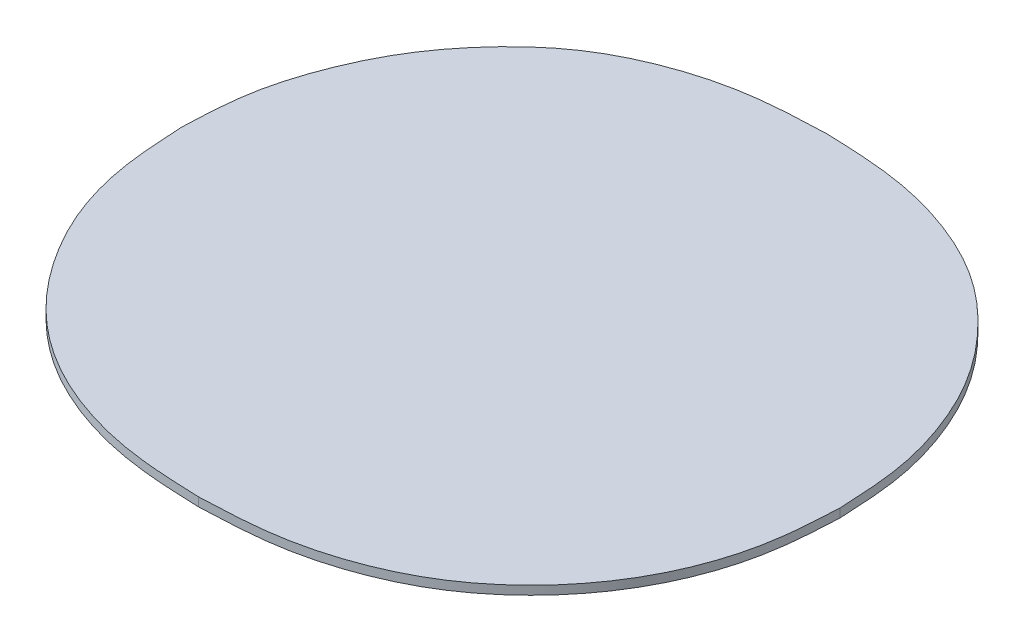
ISO-10303-21;
HEADER;
FILE_DESCRIPTION(('STEP AP214'),'2;1');
FILE_NAME('part.step','',(''),(''),'','','');
FILE_SCHEMA(('AUTOMOTIVE_DESIGN { 1 0 10303 214 1 1 1 1 }'));
ENDSEC;
DATA;
#1=APPLICATION_CONTEXT('core data for automotive mechanical design processes');
#2=APPLICATION_PROTOCOL_DEFINITION('international standard','automotive_design',2000,#1);
#3=PRODUCT_CONTEXT('',#1,'mechanical');
#4=PRODUCT('Part','Part','',(#3));
#5=PRODUCT_RELATED_PRODUCT_CATEGORY('part','',(#4));
#6=PRODUCT_DEFINITION_FORMATION('','',#4);
#7=PRODUCT_DEFINITION_CONTEXT('part definition',#1,'design');
#8=PRODUCT_DEFINITION('design','',#6,#7);
#9=PRODUCT_DEFINITION_SHAPE('','',#8);
#10=(LENGTH_UNIT() NAMED_UNIT(*) SI_UNIT(.MILLI.,.METRE.));
#11=(NAMED_UNIT(*) PLANE_ANGLE_UNIT() SI_UNIT($,.RADIAN.));
#12=(NAMED_UNIT(*) SI_UNIT($,.STERADIAN.) SOLID_ANGLE_UNIT());
#13=UNCERTAINTY_MEASURE_WITH_UNIT(LENGTH_MEASURE(1.E-05),#10,'distance_accuracy_value','');
#14=(GEOMETRIC_REPRESENTATION_CONTEXT(3) GLOBAL_UNCERTAINTY_ASSIGNED_CONTEXT((#13)) GLOBAL_UNIT_ASSIGNED_CONTEXT((#10,
#11,#12)) REPRESENTATION_CONTEXT('',''));
#15=CARTESIAN_POINT('',(0.,0.,0.));
#16=DIRECTION('',(0.,0.,1.));
#17=DIRECTION('',(1.,0.,0.));
#18=AXIS2_PLACEMENT_3D('',#15,#16,#17);
#19=CARTESIAN_POINT('',(0.007745843497059,6.,3.45268147772));
#20=DIRECTION('',(0.,-1.,3.619292183782E-13));
#21=DIRECTION('',(-1.,0.,0.));
#22=AXIS2_PLACEMENT_3D('',#19,#20,#21);
#23=PLANE('',#22);
#24=CARTESIAN_POINT('',(0.278414164254,6.,3.35562330677));
#25=CARTESIAN_POINT('',(0.249406832938,6.,3.356618688139));
#26=CARTESIAN_POINT('',(0.194479534186,6.,3.358503508541));
#27=CARTESIAN_POINT('',(0.117325820873,6.,3.379252633205));
#28=CARTESIAN_POINT('',(0.05028233269895,6.,3.412585695103));
#29=CARTESIAN_POINT('',(-0.003394474065828,6.,3.461246247859));
#30=CARTESIAN_POINT('',(-0.04635484666059,6.,3.517139603769));
#31=CARTESIAN_POINT('',(-0.07622178940424,6.,3.580280938425));
#32=CARTESIAN_POINT('',(-0.09617269501434,6.,3.648178507315));
#33=CARTESIAN_POINT('',(-0.0979894315795,6.,3.695763959134));
#34=CARTESIAN_POINT('',(-0.09891591307607,6.,3.720031121177));
#35=B_SPLINE_CURVE_WITH_KNOTS('',3,(#24,#25,#26,#27,#28,#29,#30,#31,#32,#33,#34),.UNSPECIFIED.,
.F.,.F.,(4,1,1,1,1,1,1,1,4),(0.,0.147070722438,0.278488131886,0.402823434919,0.523803973376,
0.643325091294,0.758850506969,0.877020946523,1.),.UNSPECIFIED.);
#36=CARTESIAN_POINT('',(0.278414164254,6.,3.35562330677));
#37=VERTEX_POINT('',#36);
#38=CARTESIAN_POINT('',(-0.09891591307607,6.,3.720031121177));
#39=VERTEX_POINT('',#38);
#40=EDGE_CURVE('E21',#37,#39,#35,.T.);
#41=ORIENTED_EDGE('',*,*,#40,.F.);
#42=CARTESIAN_POINT('',(0.657682581022,6.,3.720031121177));
#43=CARTESIAN_POINT('',(0.656501751618,6.,3.695340229959));
#44=CARTESIAN_POINT('',(0.654206855434,6.,3.647354439777));
#45=CARTESIAN_POINT('',(0.634460594808,6.,3.578539306237));
#46=CARTESIAN_POINT('',(0.603369311714,6.,3.515359088914));
#47=CARTESIAN_POINT('',(0.558844850105,6.,3.459826685172));
#48=CARTESIAN_POINT('',(0.504162955929,6.,3.41241901655));
#49=CARTESIAN_POINT('',(0.437309563432,6.,3.379166704267));
#50=CARTESIAN_POINT('',(0.361031610267,6.,3.358673341463));
#51=CARTESIAN_POINT('',(0.306766921803,6.,3.356670021457));
#52=CARTESIAN_POINT('',(0.278414164254,6.,3.35562330677));
#53=B_SPLINE_CURVE_WITH_KNOTS('',3,(#42,#43,#44,#45,#46,#47,#48,#49,#50,#51,#52),.UNSPECIFIED.,
.F.,.F.,(4,1,1,1,1,1,1,1,4),(0.,0.125140501017,0.243205713875,0.360575089902,0.480464490815,
0.602278419052,0.725031121478,0.85633150826,1.),.UNSPECIFIED.);
#54=CARTESIAN_POINT('',(0.657682581022,6.,3.720031121177));
#55=VERTEX_POINT('',#54);
#56=EDGE_CURVE('E30',#55,#37,#53,.T.);
#57=ORIENTED_EDGE('',*,*,#56,.F.);
#58=CARTESIAN_POINT('',(0.278414164254,6.,4.077331690978));
#59=CARTESIAN_POINT('',(0.306327278281,6.,4.076225642079));
#60=CARTESIAN_POINT('',(0.359880026209,6.,4.074103630261));
#61=CARTESIAN_POINT('',(0.435373317215,6.,4.054271015846));
#62=CARTESIAN_POINT('',(0.501969156188,6.,4.022337892375));
#63=CARTESIAN_POINT('',(0.557682396666,6.,3.977146928348));
#64=CARTESIAN_POINT('',(0.602533452824,6.,3.922804432609));
#65=CARTESIAN_POINT('',(0.63486365485,6.,3.860751853558));
#66=CARTESIAN_POINT('',(0.654059455164,6.,3.792229577449));
#67=CARTESIAN_POINT('',(0.656455129193,6.,3.744490698532));
#68=CARTESIAN_POINT('',(0.657682581022,6.,3.720031121177));
#69=B_SPLINE_CURVE_WITH_KNOTS('',3,(#58,#59,#60,#61,#62,#63,#64,#65,#66,#67,#68),.UNSPECIFIED.,
.F.,.F.,(4,1,1,1,1,1,1,1,4),(0.,0.142815348214,0.273998606379,0.396915772417,0.518617682172,
0.638605678926,0.755612013719,0.874784934405,1.),.UNSPECIFIED.);
#70=CARTESIAN_POINT('',(0.278414164254,6.,4.077331690978));
#71=VERTEX_POINT('',#70);
#72=EDGE_CURVE('E104',#71,#55,#69,.T.);
#73=ORIENTED_EDGE('',*,*,#72,.F.);
#74=CARTESIAN_POINT('',(-0.09891591307607,6.,3.720031121177));
#75=CARTESIAN_POINT('',(-0.09762280702379,6.,3.74425710157));
#76=CARTESIAN_POINT('',(-0.09510223079358,6.,3.791479392597));
#77=CARTESIAN_POINT('',(-0.07688443142966,6.,3.859490943886));
#78=CARTESIAN_POINT('',(-0.04464820256883,6.,3.920789872695));
#79=CARTESIAN_POINT('',(-0.001659156104891,6.,3.97601655347));
#80=CARTESIAN_POINT('',(0.05366003167216,6.,4.021750590806));
#81=CARTESIAN_POINT('',(0.120002053384,6.,4.054392398375));
#82=CARTESIAN_POINT('',(0.196095209431,6.,4.074171872897));
#83=CARTESIAN_POINT('',(0.250073367164,6.,4.07624382776));
#84=CARTESIAN_POINT('',(0.278414164254,6.,4.077331690978));
#85=B_SPLINE_CURVE_WITH_KNOTS('',3,(#74,#75,#76,#77,#78,#79,#80,#81,#82,#83,#84),.UNSPECIFIED.,
.F.,.F.,(4,1,1,1,1,1,1,1,4),(0.,0.124356659586,0.242401185633,0.358143816009,0.477839754427,
0.59961742931,0.7232639245,0.854701951811,1.),.UNSPECIFIED.);
#86=EDGE_CURVE('E66',#39,#71,#85,.T.);
#87=ORIENTED_EDGE('',*,*,#86,.F.);
#88=EDGE_LOOP('',(#41,#57,#73,#87));
#89=FACE_BOUND('',#88,.T.);
#90=ADVANCED_FACE('F16',(#89),#23,.T.);
#91=CARTESIAN_POINT('',(0.007745843497059,6.01,3.45268147772));
#92=DIRECTION('',(0.,-1.,3.619292183782E-13));
#93=DIRECTION('',(-1.,0.,0.));
#94=AXIS2_PLACEMENT_3D('',#91,#92,#93);
#95=PLANE('',#94);
#96=CARTESIAN_POINT('',(0.278414164254,6.01,3.35562330677));
#97=CARTESIAN_POINT('',(0.249406832938,6.01,3.356618688139));
#98=CARTESIAN_POINT('',(0.194479534186,6.01,3.358503508541));
#99=CARTESIAN_POINT('',(0.117325820873,6.01,3.379252633205));
#100=CARTESIAN_POINT('',(0.05028233269895,6.01,3.412585695103));
#101=CARTESIAN_POINT('',(-0.003394474065828,6.01,3.461246247859));
#102=CARTESIAN_POINT('',(-0.04635484666059,6.01,3.517139603769));
#103=CARTESIAN_POINT('',(-0.07622178940424,6.01,3.580280938425));
#104=CARTESIAN_POINT('',(-0.09617269501434,6.01,3.648178507315));
#105=CARTESIAN_POINT('',(-0.0979894315795,6.01,3.695763959134));
#106=CARTESIAN_POINT('',(-0.09891591307607,6.01,3.720031121177));
#107=B_SPLINE_CURVE_WITH_KNOTS('',3,(#96,#97,#98,#99,#100,#101,#102,#103,#104,#105,#106),
.UNSPECIFIED.,.F.,.F.,(4,1,1,1,1,1,1,1,4),(0.,0.147070722438,0.278488131886,0.402823434919,
0.523803973376,0.643325091294,0.758850506969,0.877020946523,1.),.UNSPECIFIED.);
#108=CARTESIAN_POINT('',(0.278414164254,6.01,3.35562330677));
#109=VERTEX_POINT('',#108);
#110=CARTESIAN_POINT('',(-0.09891591307607,6.01,3.720031121177));
#111=VERTEX_POINT('',#110);
#112=EDGE_CURVE('E86',#109,#111,#107,.T.);
#113=ORIENTED_EDGE('',*,*,#112,.T.);
#114=CARTESIAN_POINT('',(-0.09891591307607,6.01,3.720031121177));
#115=CARTESIAN_POINT('',(-0.09762280702379,6.01,3.74425710157));
#116=CARTESIAN_POINT('',(-0.09510223079358,6.01,3.791479392597));
#117=CARTESIAN_POINT('',(-0.07688443142966,6.01,3.859490943886));
#118=CARTESIAN_POINT('',(-0.04464820256883,6.01,3.920789872695));
#119=CARTESIAN_POINT('',(-0.001659156104891,6.01,3.97601655347));
#120=CARTESIAN_POINT('',(0.05366003167216,6.01,4.021750590806));
#121=CARTESIAN_POINT('',(0.120002053384,6.01,4.054392398375));
#122=CARTESIAN_POINT('',(0.196095209431,6.01,4.074171872897));
#123=CARTESIAN_POINT('',(0.250073367164,6.01,4.07624382776));
#124=CARTESIAN_POINT('',(0.278414164254,6.01,4.077331690978));
#125=B_SPLINE_CURVE_WITH_KNOTS('',3,(#114,#115,#116,#117,#118,#119,#120,#121,#122,#123,#124),
.UNSPECIFIED.,.F.,.F.,(4,1,1,1,1,1,1,1,4),(0.,0.124356659586,0.242401185633,0.358143816009,
0.477839754427,0.59961742931,0.7232639245,0.854701951811,1.),.UNSPECIFIED.);
#126=CARTESIAN_POINT('',(0.278414164254,6.01,4.077331690978));
#127=VERTEX_POINT('',#126);
#128=EDGE_CURVE('E109',#111,#127,#125,.T.);
#129=ORIENTED_EDGE('',*,*,#128,.T.);
#130=CARTESIAN_POINT('',(0.278414164254,6.01,4.077331690978));
#131=CARTESIAN_POINT('',(0.306327278281,6.01,4.076225642079));
#132=CARTESIAN_POINT('',(0.359880026209,6.01,4.074103630261));
#133=CARTESIAN_POINT('',(0.435373317215,6.01,4.054271015846));
#134=CARTESIAN_POINT('',(0.501969156188,6.01,4.022337892375));
#135=CARTESIAN_POINT('',(0.557682396666,6.01,3.977146928348));
#136=CARTESIAN_POINT('',(0.602533452824,6.01,3.922804432609));
#137=CARTESIAN_POINT('',(0.63486365485,6.01,3.860751853558));
#138=CARTESIAN_POINT('',(0.654059455164,6.01,3.792229577449));
#139=CARTESIAN_POINT('',(0.656455129193,6.01,3.744490698532));
#140=CARTESIAN_POINT('',(0.657682581022,6.01,3.720031121177));
#141=B_SPLINE_CURVE_WITH_KNOTS('',3,(#130,#131,#132,#133,#134,#135,#136,#137,#138,#139,#140),
.UNSPECIFIED.,.F.,.F.,(4,1,1,1,1,1,1,1,4),(0.,0.142815348214,0.273998606379,0.396915772417,
0.518617682172,0.638605678926,0.755612013719,0.874784934405,1.),.UNSPECIFIED.);
#142=CARTESIAN_POINT('',(0.657682581022,6.01,3.720031121177));
#143=VERTEX_POINT('',#142);
#144=EDGE_CURVE('E80',#127,#143,#141,.T.);
#145=ORIENTED_EDGE('',*,*,#144,.T.);
#146=CARTESIAN_POINT('',(0.657682581022,6.01,3.720031121177));
#147=CARTESIAN_POINT('',(0.656501751618,6.01,3.695340229959));
#148=CARTESIAN_POINT('',(0.654206855434,6.01,3.647354439777));
#149=CARTESIAN_POINT('',(0.634460594808,6.01,3.578539306237));
#150=CARTESIAN_POINT('',(0.603369311714,6.01,3.515359088914));
#151=CARTESIAN_POINT('',(0.558844850105,6.01,3.459826685172));
#152=CARTESIAN_POINT('',(0.504162955929,6.01,3.41241901655));
#153=CARTESIAN_POINT('',(0.437309563432,6.01,3.379166704267));
#154=CARTESIAN_POINT('',(0.361031610267,6.01,3.358673341463));
#155=CARTESIAN_POINT('',(0.306766921803,6.01,3.356670021457));
#156=CARTESIAN_POINT('',(0.278414164254,6.01,3.35562330677));
#157=B_SPLINE_CURVE_WITH_KNOTS('',3,(#146,#147,#148,#149,#150,#151,#152,#153,#154,#155,#156),
.UNSPECIFIED.,.F.,.F.,(4,1,1,1,1,1,1,1,4),(0.,0.125140501017,0.243205713875,0.360575089902,
0.480464490815,0.602278419052,0.725031121478,0.85633150826,1.),.UNSPECIFIED.);
#158=EDGE_CURVE('E11',#143,#109,#157,.T.);
#159=ORIENTED_EDGE('',*,*,#158,.T.);
#160=EDGE_LOOP('',(#113,#129,#145,#159));
#161=FACE_BOUND('',#160,.T.);
#162=ADVANCED_FACE('F160',(#161),#95,.F.);
#163=CARTESIAN_POINT('',(0.657682581022,6.01,3.720031121177));
#164=CARTESIAN_POINT('',(0.656501751618,6.01,3.695340229959));
#165=CARTESIAN_POINT('',(0.654206855434,6.01,3.647354439777));
#166=CARTESIAN_POINT('',(0.634460594808,6.01,3.578539306237));
#167=CARTESIAN_POINT('',(0.603369311714,6.01,3.515359088914));
#168=CARTESIAN_POINT('',(0.558844850105,6.01,3.459826685172));
#169=CARTESIAN_POINT('',(0.504162955929,6.01,3.41241901655));
#170=CARTESIAN_POINT('',(0.437309563432,6.01,3.379166704267));
#171=CARTESIAN_POINT('',(0.361031610267,6.01,3.358673341463));
#172=CARTESIAN_POINT('',(0.306766921803,6.01,3.356670021457));
#173=CARTESIAN_POINT('',(0.278414164254,6.01,3.35562330677));
#174=(BOUNDED_CURVE() B_SPLINE_CURVE(3,(#163,#164,#165,#166,#167,#168,#169,#170,#171,#172,#173),
.UNSPECIFIED.,.F.,.F.) B_SPLINE_CURVE_WITH_KNOTS((4,1,1,1,1,1,1,1,4),(0.,0.125140501017,
0.243205713875,0.360575089902,0.480464490815,0.602278419052,0.725031121478,0.85633150826,1.),
.UNSPECIFIED.) CURVE() GEOMETRIC_REPRESENTATION_ITEM() RATIONAL_B_SPLINE_CURVE((1.,1.,1.,1.,1.,
1.,1.,1.,1.,1.,1.)) REPRESENTATION_ITEM(''));
#175=DIRECTION('',(0.,-1.,0.));
#176=VECTOR('',#175,1.);
#177=SURFACE_OF_LINEAR_EXTRUSION('',#174,#176);
#178=ORIENTED_EDGE('',*,*,#56,.T.);
#179=DIRECTION('',(0.,-1.,0.));
#180=VECTOR('',#179,1.);
#181=CARTESIAN_POINT('',(0.278414164254,6.01,3.35562330677));
#182=LINE('',#181,#180);
#183=EDGE_CURVE('E74',#109,#37,#182,.T.);
#184=ORIENTED_EDGE('',*,*,#183,.F.);
#185=ORIENTED_EDGE('',*,*,#158,.F.);
#186=DIRECTION('',(0.,-1.,0.));
#187=VECTOR('',#186,1.);
#188=CARTESIAN_POINT('',(0.657682581022,6.01,3.720031121177));
#189=LINE('',#188,#187);
#190=EDGE_CURVE('E77',#143,#55,#189,.T.);
#191=ORIENTED_EDGE('',*,*,#190,.T.);
#192=EDGE_LOOP('',(#178,#184,#185,#191));
#193=FACE_BOUND('',#192,.T.);
#194=ADVANCED_FACE('F73',(#193),#177,.F.);
#195=CARTESIAN_POINT('',(0.278414164254,6.01,4.077331690978));
#196=CARTESIAN_POINT('',(0.306327278281,6.01,4.076225642079));
#197=CARTESIAN_POINT('',(0.359880026209,6.01,4.074103630261));
#198=CARTESIAN_POINT('',(0.435373317215,6.01,4.054271015846));
#199=CARTESIAN_POINT('',(0.501969156188,6.01,4.022337892375));
#200=CARTESIAN_POINT('',(0.557682396666,6.01,3.977146928348));
#201=CARTESIAN_POINT('',(0.602533452824,6.01,3.922804432609));
#202=CARTESIAN_POINT('',(0.63486365485,6.01,3.860751853558));
#203=CARTESIAN_POINT('',(0.654059455164,6.01,3.792229577449));
#204=CARTESIAN_POINT('',(0.656455129193,6.01,3.744490698532));
#205=CARTESIAN_POINT('',(0.657682581022,6.01,3.720031121177));
#206=(BOUNDED_CURVE() B_SPLINE_CURVE(3,(#195,#196,#197,#198,#199,#200,#201,#202,#203,#204,#205),
.UNSPECIFIED.,.F.,.F.) B_SPLINE_CURVE_WITH_KNOTS((4,1,1,1,1,1,1,1,4),(0.,0.142815348214,
0.273998606379,0.396915772417,0.518617682172,0.638605678926,0.755612013719,0.874784934405,1.),
.UNSPECIFIED.) CURVE() GEOMETRIC_REPRESENTATION_ITEM() RATIONAL_B_SPLINE_CURVE((1.,1.,1.,1.,1.,
1.,1.,1.,1.,1.,1.)) REPRESENTATION_ITEM(''));
#207=DIRECTION('',(0.,-1.,0.));
#208=VECTOR('',#207,1.);
#209=SURFACE_OF_LINEAR_EXTRUSION('',#206,#208);
#210=ORIENTED_EDGE('',*,*,#72,.T.);
#211=ORIENTED_EDGE('',*,*,#190,.F.);
#212=ORIENTED_EDGE('',*,*,#144,.F.);
#213=DIRECTION('',(0.,-1.,0.));
#214=VECTOR('',#213,1.);
#215=CARTESIAN_POINT('',(0.278414164254,6.01,4.077331690978));
#216=LINE('',#215,#214);
#217=EDGE_CURVE('E106',#127,#71,#216,.T.);
#218=ORIENTED_EDGE('',*,*,#217,.T.);
#219=EDGE_LOOP('',(#210,#211,#212,#218));
#220=FACE_BOUND('',#219,.T.);
#221=ADVANCED_FACE('F158',(#220),#209,.F.);
#222=CARTESIAN_POINT('',(-0.09891591307607,6.01,3.720031121177));
#223=CARTESIAN_POINT('',(-0.09762280702379,6.01,3.74425710157));
#224=CARTESIAN_POINT('',(-0.09510223079358,6.01,3.791479392597));
#225=CARTESIAN_POINT('',(-0.07688443142966,6.01,3.859490943886));
#226=CARTESIAN_POINT('',(-0.04464820256883,6.01,3.920789872695));
#227=CARTESIAN_POINT('',(-0.001659156104891,6.01,3.97601655347));
#228=CARTESIAN_POINT('',(0.05366003167216,6.01,4.021750590806));
#229=CARTESIAN_POINT('',(0.120002053384,6.01,4.054392398375));
#230=CARTESIAN_POINT('',(0.196095209431,6.01,4.074171872897));
#231=CARTESIAN_POINT('',(0.250073367164,6.01,4.07624382776));
#232=CARTESIAN_POINT('',(0.278414164254,6.01,4.077331690978));
#233=(BOUNDED_CURVE() B_SPLINE_CURVE(3,(#222,#223,#224,#225,#226,#227,#228,#229,#230,#231,#232),
.UNSPECIFIED.,.F.,.F.) B_SPLINE_CURVE_WITH_KNOTS((4,1,1,1,1,1,1,1,4),(0.,0.124356659586,
0.242401185633,0.358143816009,0.477839754427,0.59961742931,0.7232639245,0.854701951811,1.),
.UNSPECIFIED.) CURVE() GEOMETRIC_REPRESENTATION_ITEM() RATIONAL_B_SPLINE_CURVE((1.,1.,1.,1.,1.,
1.,1.,1.,1.,1.,1.)) REPRESENTATION_ITEM(''));
#234=DIRECTION('',(0.,-1.,0.));
#235=VECTOR('',#234,1.);
#236=SURFACE_OF_LINEAR_EXTRUSION('',#233,#235);
#237=ORIENTED_EDGE('',*,*,#86,.T.);
#238=ORIENTED_EDGE('',*,*,#217,.F.);
#239=ORIENTED_EDGE('',*,*,#128,.F.);
#240=DIRECTION('',(0.,-1.,0.));
#241=VECTOR('',#240,1.);
#242=CARTESIAN_POINT('',(-0.09891591307607,6.01,3.720031121177));
#243=LINE('',#242,#241);
#244=EDGE_CURVE('E90',#111,#39,#243,.T.);
#245=ORIENTED_EDGE('',*,*,#244,.T.);
#246=EDGE_LOOP('',(#237,#238,#239,#245));
#247=FACE_BOUND('',#246,.T.);
#248=ADVANCED_FACE('F155',(#247),#236,.F.);
#249=CARTESIAN_POINT('',(0.278414164254,6.01,3.35562330677));
#250=CARTESIAN_POINT('',(0.249406832938,6.01,3.356618688139));
#251=CARTESIAN_POINT('',(0.194479534186,6.01,3.358503508541));
#252=CARTESIAN_POINT('',(0.117325820873,6.01,3.379252633205));
#253=CARTESIAN_POINT('',(0.05028233269895,6.01,3.412585695103));
#254=CARTESIAN_POINT('',(-0.003394474065828,6.01,3.461246247859));
#255=CARTESIAN_POINT('',(-0.04635484666059,6.01,3.517139603769));
#256=CARTESIAN_POINT('',(-0.07622178940424,6.01,3.580280938425));
#257=CARTESIAN_POINT('',(-0.09617269501434,6.01,3.648178507315));
#258=CARTESIAN_POINT('',(-0.0979894315795,6.01,3.695763959134));
#259=CARTESIAN_POINT('',(-0.09891591307607,6.01,3.720031121177));
#260=(BOUNDED_CURVE() B_SPLINE_CURVE(3,(#249,#250,#251,#252,#253,#254,#255,#256,#257,#258,#259),
.UNSPECIFIED.,.F.,.F.) B_SPLINE_CURVE_WITH_KNOTS((4,1,1,1,1,1,1,1,4),(0.,0.147070722438,
0.278488131886,0.402823434919,0.523803973376,0.643325091294,0.758850506969,0.877020946523,1.),
.UNSPECIFIED.) CURVE() GEOMETRIC_REPRESENTATION_ITEM() RATIONAL_B_SPLINE_CURVE((1.,1.,1.,1.,1.,
1.,1.,1.,1.,1.,1.)) REPRESENTATION_ITEM(''));
#261=DIRECTION('',(0.,-1.,0.));
#262=VECTOR('',#261,1.);
#263=SURFACE_OF_LINEAR_EXTRUSION('',#260,#262);
#264=ORIENTED_EDGE('',*,*,#40,.T.);
#265=ORIENTED_EDGE('',*,*,#244,.F.);
#266=ORIENTED_EDGE('',*,*,#112,.F.);
#267=ORIENTED_EDGE('',*,*,#183,.T.);
#268=EDGE_LOOP('',(#264,#265,#266,#267));
#269=FACE_BOUND('',#268,.T.);
#270=ADVANCED_FACE('F18',(#269),#263,.F.);
#271=CLOSED_SHELL('',(#90,#162,#194,#221,#248,#270));
#272=MANIFOLD_SOLID_BREP('B1',#271);
#273=ADVANCED_BREP_SHAPE_REPRESENTATION('',(#18,#272),#14);
#274=SHAPE_DEFINITION_REPRESENTATION(#9,#273);
ENDSEC;
END-ISO-10303-21;
